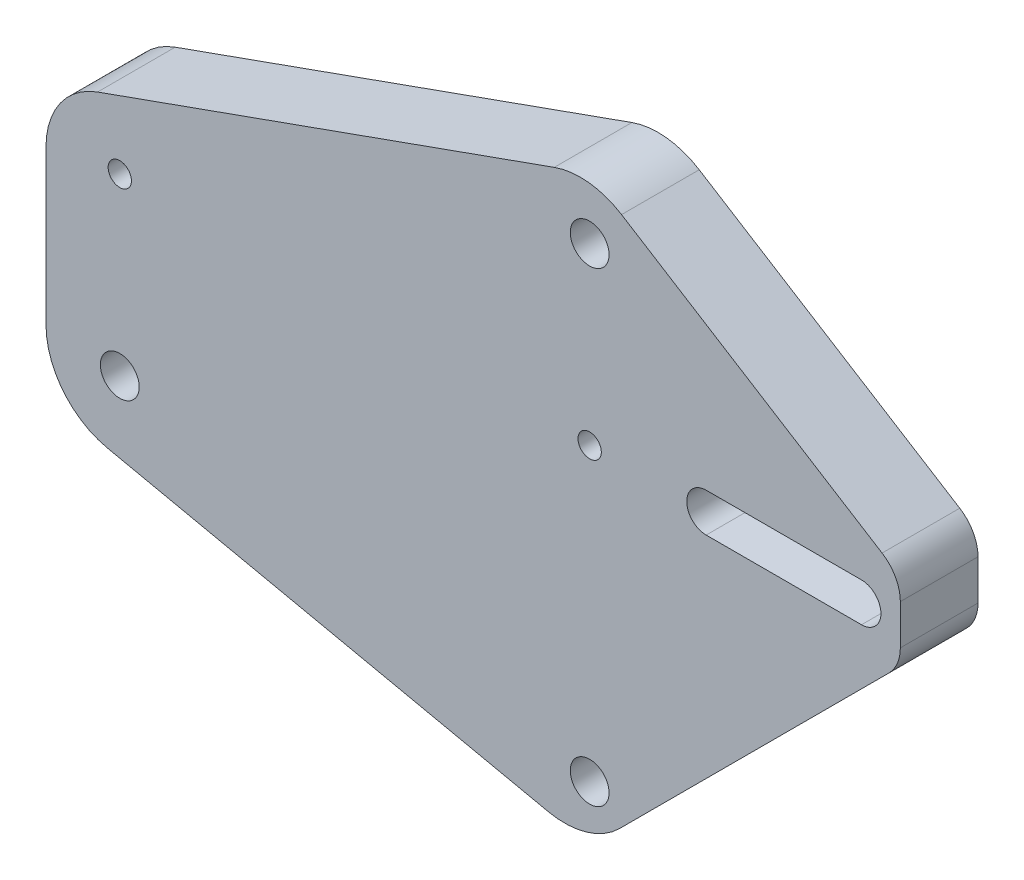
ISO-10303-21;
HEADER;
FILE_DESCRIPTION(('STEP AP214'),'2;1');
FILE_NAME('part.step','',(''),(''),'','','');
FILE_SCHEMA(('AUTOMOTIVE_DESIGN { 1 0 10303 214 1 1 1 1 }'));
ENDSEC;
DATA;
#1=APPLICATION_CONTEXT('core data for automotive mechanical design processes');
#2=APPLICATION_PROTOCOL_DEFINITION('international standard','automotive_design',2000,#1);
#3=PRODUCT_CONTEXT('',#1,'mechanical');
#4=PRODUCT('Part','Part','',(#3));
#5=PRODUCT_RELATED_PRODUCT_CATEGORY('part','',(#4));
#6=PRODUCT_DEFINITION_FORMATION('','',#4);
#7=PRODUCT_DEFINITION_CONTEXT('part definition',#1,'design');
#8=PRODUCT_DEFINITION('design','',#6,#7);
#9=PRODUCT_DEFINITION_SHAPE('','',#8);
#10=(LENGTH_UNIT() NAMED_UNIT(*) SI_UNIT(.MILLI.,.METRE.));
#11=(NAMED_UNIT(*) PLANE_ANGLE_UNIT() SI_UNIT($,.RADIAN.));
#12=(NAMED_UNIT(*) SI_UNIT($,.STERADIAN.) SOLID_ANGLE_UNIT());
#13=UNCERTAINTY_MEASURE_WITH_UNIT(LENGTH_MEASURE(1.E-05),#10,'distance_accuracy_value','');
#14=(GEOMETRIC_REPRESENTATION_CONTEXT(3) GLOBAL_UNCERTAINTY_ASSIGNED_CONTEXT((#13)) GLOBAL_UNIT_ASSIGNED_CONTEXT((#10,
#11,#12)) REPRESENTATION_CONTEXT('',''));
#15=CARTESIAN_POINT('',(0.,0.,0.));
#16=DIRECTION('',(0.,0.,1.));
#17=DIRECTION('',(1.,0.,0.));
#18=AXIS2_PLACEMENT_3D('',#15,#16,#17);
#19=CARTESIAN_POINT('',(-41.1951987154768,23.9545227821022,10.));
#20=DIRECTION('',(0.,0.,1.));
#21=DIRECTION('',(1.,0.,0.));
#22=AXIS2_PLACEMENT_3D('',#19,#20,#21);
#23=PLANE('',#22);
#24=CARTESIAN_POINT('',(-100.5,-17.850085197835,10.));
#25=DIRECTION('',(0.,0.,1.));
#26=DIRECTION('',(1.,0.,0.));
#27=AXIS2_PLACEMENT_3D('',#24,#25,#26);
#28=CIRCLE('',#27,2.5);
#29=CARTESIAN_POINT('',(-98.,-17.850085197835,10.));
#30=VERTEX_POINT('',#29);
#31=EDGE_CURVE('E601',#30,#30,#28,.T.);
#32=ORIENTED_EDGE('',*,*,#31,.F.);
#33=EDGE_LOOP('',(#32));
#34=FACE_BOUND('',#33,.T.);
#35=CARTESIAN_POINT('',(-40.,27.149914802165,10.));
#36=DIRECTION('',(0.,0.,1.));
#37=DIRECTION('',(1.,0.,0.));
#38=AXIS2_PLACEMENT_3D('',#35,#36,#37);
#39=CIRCLE('',#38,2.5);
#40=CARTESIAN_POINT('',(-37.5,27.149914802165,10.));
#41=VERTEX_POINT('',#40);
#42=EDGE_CURVE('E188',#41,#41,#39,.T.);
#43=ORIENTED_EDGE('',*,*,#42,.F.);
#44=EDGE_LOOP('',(#43));
#45=FACE_BOUND('',#44,.T.);
#46=CARTESIAN_POINT('',(-41.1951987154768,23.9545227821022,10.));
#47=DIRECTION('',(0.,0.,1.));
#48=DIRECTION('',(1.,0.,0.));
#49=AXIS2_PLACEMENT_3D('',#46,#47,#48);
#50=CIRCLE('',#49,10.);
#51=CARTESIAN_POINT('',(-35.895209315445,32.4345058221531,10.));
#52=VERTEX_POINT('',#51);
#53=CARTESIAN_POINT('',(-44.5585626854584,33.3719418980506,10.));
#54=VERTEX_POINT('',#53);
#55=EDGE_CURVE('E212',#52,#54,#50,.T.);
#56=ORIENTED_EDGE('',*,*,#55,.T.);
#57=DIRECTION('',(-0.941741911594837,-0.336336396998156,0.));
#58=VECTOR('',#57,1.);
#59=CARTESIAN_POINT('',(-44.5585626854584,33.3719418980506,10.));
#60=LINE('',#59,#58);
#61=CARTESIAN_POINT('',(-103.363363969982,12.370227153578,10.));
#62=VERTEX_POINT('',#61);
#63=EDGE_CURVE('E216',#54,#62,#60,.T.);
#64=ORIENTED_EDGE('',*,*,#63,.T.);
#65=CARTESIAN_POINT('',(-100.,2.95280803762964,10.));
#66=DIRECTION('',(0.,0.,1.));
#67=DIRECTION('',(1.,0.,0.));
#68=AXIS2_PLACEMENT_3D('',#65,#66,#67);
#69=CIRCLE('',#68,9.99999999999998);
#70=CARTESIAN_POINT('',(-110.,2.95280803762964,10.));
#71=VERTEX_POINT('',#70);
#72=EDGE_CURVE('E220',#62,#71,#69,.T.);
#73=ORIENTED_EDGE('',*,*,#72,.T.);
#74=DIRECTION('',(0.,-1.,0.));
#75=VECTOR('',#74,1.);
#76=CARTESIAN_POINT('',(-110.,2.95280803762964,10.));
#77=LINE('',#76,#75);
#78=CARTESIAN_POINT('',(-110.,-16.9158420976597,10.));
#79=VERTEX_POINT('',#78);
#80=EDGE_CURVE('E223',#71,#79,#77,.T.);
#81=ORIENTED_EDGE('',*,*,#80,.T.);
#82=CARTESIAN_POINT('',(-100.,-16.9158420976597,10.));
#83=DIRECTION('',(0.,0.,1.));
#84=DIRECTION('',(1.,0.,0.));
#85=AXIS2_PLACEMENT_3D('',#82,#83,#84);
#86=CIRCLE('',#85,10.);
#87=CARTESIAN_POINT('',(-102.095290887309,-26.6938662384338,10.));
#88=VERTEX_POINT('',#87);
#89=EDGE_CURVE('E226',#79,#88,#86,.T.);
#90=ORIENTED_EDGE('',*,*,#89,.T.);
#91=DIRECTION('',(0.97780241407741,-0.209529088730873,0.));
#92=VECTOR('',#91,1.);
#93=CARTESIAN_POINT('',(-102.095290887309,-26.6938662384338,10.));
#94=LINE('',#93,#92);
#95=CARTESIAN_POINT('',(-45.3195078343364,-38.8601054640708,10.));
#96=VERTEX_POINT('',#95);
#97=EDGE_CURVE('E229',#88,#96,#94,.T.);
#98=ORIENTED_EDGE('',*,*,#97,.T.);
#99=CARTESIAN_POINT('',(-43.2242169470276,-29.0820813232967,10.));
#100=DIRECTION('',(0.,0.,1.));
#101=DIRECTION('',(1.,0.,0.));
#102=AXIS2_PLACEMENT_3D('',#99,#100,#101);
#103=CIRCLE('',#102,10.);
#104=CARTESIAN_POINT('',(-36.1531491351622,-36.1531491351622,10.));
#105=VERTEX_POINT('',#104);
#106=EDGE_CURVE('E232',#96,#105,#103,.T.);
#107=ORIENTED_EDGE('',*,*,#106,.T.);
#108=DIRECTION('',(0.707106781186547,0.707106781186548,0.));
#109=VECTOR('',#108,1.);
#110=CARTESIAN_POINT('',(-36.1531491351622,-36.1531491351622,10.));
#111=LINE('',#110,#109);
#112=CARTESIAN_POINT('',(-1.46446609406726,-1.46446609406727,10.));
#113=VERTEX_POINT('',#112);
#114=EDGE_CURVE('E235',#105,#113,#111,.T.);
#115=ORIENTED_EDGE('',*,*,#114,.T.);
#116=CARTESIAN_POINT('',(-5.,2.07106781186547,10.));
#117=DIRECTION('',(0.,0.,1.));
#118=DIRECTION('',(-1.,0.,0.));
#119=AXIS2_PLACEMENT_3D('',#116,#117,#118);
#120=CIRCLE('',#119,5.);
#121=CARTESIAN_POINT('',(0.,2.07106781186547,10.));
#122=VERTEX_POINT('',#121);
#123=EDGE_CURVE('E238',#113,#122,#120,.T.);
#124=ORIENTED_EDGE('',*,*,#123,.T.);
#125=DIRECTION('',(0.,1.,0.));
#126=VECTOR('',#125,1.);
#127=CARTESIAN_POINT('',(0.,7.22876179246463,10.));
#128=LINE('',#127,#126);
#129=CARTESIAN_POINT('',(0.,7.22876179246463,10.));
#130=VERTEX_POINT('',#129);
#131=EDGE_CURVE('E241',#122,#130,#128,.T.);
#132=ORIENTED_EDGE('',*,*,#131,.T.);
#133=CARTESIAN_POINT('',(-5.,7.22876179246463,10.));
#134=DIRECTION('',(0.,0.,1.));
#135=DIRECTION('',(-1.,0.,0.));
#136=AXIS2_PLACEMENT_3D('',#133,#134,#135);
#137=CIRCLE('',#136,5.);
#138=CARTESIAN_POINT('',(-2.3500052999841,11.4687533124901,10.));
#139=VERTEX_POINT('',#138);
#140=EDGE_CURVE('E244',#130,#139,#137,.T.);
#141=ORIENTED_EDGE('',*,*,#140,.T.);
#142=DIRECTION('',(-0.847998304005088,0.52999894000318,0.));
#143=VECTOR('',#142,1.);
#144=CARTESIAN_POINT('',(-35.895209315445,32.4345058221531,10.));
#145=LINE('',#144,#143);
#146=EDGE_CURVE('E247',#139,#52,#145,.T.);
#147=ORIENTED_EDGE('',*,*,#146,.T.);
#148=EDGE_LOOP('',(#56,#64,#73,#81,#90,#98,#107,#115,#124,#132,#141,#147));
#149=FACE_BOUND('',#148,.T.);
#150=CARTESIAN_POINT('',(-40.,4.64991480216505,10.));
#151=DIRECTION('',(0.,0.,1.));
#152=DIRECTION('',(1.,0.,0.));
#153=AXIS2_PLACEMENT_3D('',#150,#151,#152);
#154=CIRCLE('',#153,1.5);
#155=CARTESIAN_POINT('',(-38.5,4.64991480216505,10.));
#156=VERTEX_POINT('',#155);
#157=EDGE_CURVE('E204',#156,#156,#154,.T.);
#158=ORIENTED_EDGE('',*,*,#157,.F.);
#159=EDGE_LOOP('',(#158));
#160=FACE_BOUND('',#159,.T.);
#161=DIRECTION('',(1.,0.,0.));
#162=VECTOR('',#161,1.);
#163=CARTESIAN_POINT('',(-25.,2.14991480216505,10.));
#164=LINE('',#163,#162);
#165=CARTESIAN_POINT('',(-25.,2.14991480216505,10.));
#166=VERTEX_POINT('',#165);
#167=CARTESIAN_POINT('',(-5.,2.14991480216504,10.));
#168=VERTEX_POINT('',#167);
#169=EDGE_CURVE('E162',#166,#168,#164,.T.);
#170=ORIENTED_EDGE('',*,*,#169,.F.);
#171=CARTESIAN_POINT('',(-25.,4.64991480216505,10.));
#172=DIRECTION('',(0.,0.,1.));
#173=DIRECTION('',(1.,0.,0.));
#174=AXIS2_PLACEMENT_3D('',#171,#172,#173);
#175=CIRCLE('',#174,2.5);
#176=CARTESIAN_POINT('',(-25.,7.14991480216505,10.));
#177=VERTEX_POINT('',#176);
#178=EDGE_CURVE('E153',#177,#166,#175,.T.);
#179=ORIENTED_EDGE('',*,*,#178,.F.);
#180=DIRECTION('',(-1.,0.,0.));
#181=VECTOR('',#180,1.);
#182=CARTESIAN_POINT('',(-25.,7.14991480216505,10.));
#183=LINE('',#182,#181);
#184=CARTESIAN_POINT('',(-5.,7.14991480216505,10.));
#185=VERTEX_POINT('',#184);
#186=EDGE_CURVE('E180',#185,#177,#183,.T.);
#187=ORIENTED_EDGE('',*,*,#186,.F.);
#188=CARTESIAN_POINT('',(-5.,4.64991480216505,10.));
#189=DIRECTION('',(0.,0.,1.));
#190=DIRECTION('',(1.,0.,0.));
#191=AXIS2_PLACEMENT_3D('',#188,#189,#190);
#192=CIRCLE('',#191,2.5);
#193=EDGE_CURVE('E176',#168,#185,#192,.T.);
#194=ORIENTED_EDGE('',*,*,#193,.F.);
#195=EDGE_LOOP('',(#170,#179,#187,#194));
#196=FACE_BOUND('',#195,.T.);
#197=CARTESIAN_POINT('',(-100.5,4.64991480216505,10.));
#198=DIRECTION('',(0.,0.,1.));
#199=DIRECTION('',(1.,0.,0.));
#200=AXIS2_PLACEMENT_3D('',#197,#198,#199);
#201=CIRCLE('',#200,1.5);
#202=CARTESIAN_POINT('',(-99.,4.64991480216505,10.));
#203=VERTEX_POINT('',#202);
#204=EDGE_CURVE('E609',#203,#203,#201,.T.);
#205=ORIENTED_EDGE('',*,*,#204,.F.);
#206=EDGE_LOOP('',(#205));
#207=FACE_BOUND('',#206,.T.);
#208=CARTESIAN_POINT('',(-40.,-32.850085197835,10.));
#209=DIRECTION('',(0.,0.,1.));
#210=DIRECTION('',(1.,0.,0.));
#211=AXIS2_PLACEMENT_3D('',#208,#209,#210);
#212=CIRCLE('',#211,2.5);
#213=CARTESIAN_POINT('',(-37.5,-32.850085197835,10.));
#214=VERTEX_POINT('',#213);
#215=EDGE_CURVE('E590',#214,#214,#212,.T.);
#216=ORIENTED_EDGE('',*,*,#215,.F.);
#217=EDGE_LOOP('',(#216));
#218=FACE_BOUND('',#217,.T.);
#219=ADVANCED_FACE('F39',(#34,#45,#149,#160,#196,#207,#218),#23,.T.);
#220=CARTESIAN_POINT('',(-41.1951987154768,23.9545227821022,0.));
#221=DIRECTION('',(0.,0.,1.));
#222=DIRECTION('',(1.,0.,0.));
#223=AXIS2_PLACEMENT_3D('',#220,#221,#222);
#224=PLANE('',#223);
#225=CARTESIAN_POINT('',(-40.,4.64991480216505,0.));
#226=DIRECTION('',(0.,0.,1.));
#227=DIRECTION('',(1.,0.,0.));
#228=AXIS2_PLACEMENT_3D('',#225,#226,#227);
#229=CIRCLE('',#228,1.5);
#230=CARTESIAN_POINT('',(-38.5,4.64991480216505,0.));
#231=VERTEX_POINT('',#230);
#232=EDGE_CURVE('E171',#231,#231,#229,.T.);
#233=ORIENTED_EDGE('',*,*,#232,.T.);
#234=EDGE_LOOP('',(#233));
#235=FACE_BOUND('',#234,.T.);
#236=CARTESIAN_POINT('',(-41.1951987154768,23.9545227821022,0.));
#237=DIRECTION('',(0.,0.,1.));
#238=DIRECTION('',(1.,0.,0.));
#239=AXIS2_PLACEMENT_3D('',#236,#237,#238);
#240=CIRCLE('',#239,10.);
#241=CARTESIAN_POINT('',(-35.895209315445,32.4345058221531,0.));
#242=VERTEX_POINT('',#241);
#243=CARTESIAN_POINT('',(-44.5585626854584,33.3719418980506,0.));
#244=VERTEX_POINT('',#243);
#245=EDGE_CURVE('E208',#242,#244,#240,.T.);
#246=ORIENTED_EDGE('',*,*,#245,.F.);
#247=DIRECTION('',(-0.847998304005088,0.52999894000318,0.));
#248=VECTOR('',#247,1.);
#249=CARTESIAN_POINT('',(-35.895209315445,32.4345058221531,0.));
#250=LINE('',#249,#248);
#251=CARTESIAN_POINT('',(-2.3500052999841,11.4687533124901,0.));
#252=VERTEX_POINT('',#251);
#253=EDGE_CURVE('E217',#252,#242,#250,.T.);
#254=ORIENTED_EDGE('',*,*,#253,.F.);
#255=CARTESIAN_POINT('',(-5.,7.22876179246463,0.));
#256=DIRECTION('',(0.,0.,1.));
#257=DIRECTION('',(-1.,0.,0.));
#258=AXIS2_PLACEMENT_3D('',#255,#256,#257);
#259=CIRCLE('',#258,5.);
#260=CARTESIAN_POINT('',(0.,7.22876179246463,0.));
#261=VERTEX_POINT('',#260);
#262=EDGE_CURVE('E281',#261,#252,#259,.T.);
#263=ORIENTED_EDGE('',*,*,#262,.F.);
#264=DIRECTION('',(0.,1.,0.));
#265=VECTOR('',#264,1.);
#266=CARTESIAN_POINT('',(0.,7.22876179246463,0.));
#267=LINE('',#266,#265);
#268=CARTESIAN_POINT('',(0.,2.07106781186547,0.));
#269=VERTEX_POINT('',#268);
#270=EDGE_CURVE('E278',#269,#261,#267,.T.);
#271=ORIENTED_EDGE('',*,*,#270,.F.);
#272=CARTESIAN_POINT('',(-5.,2.07106781186547,0.));
#273=DIRECTION('',(0.,0.,1.));
#274=DIRECTION('',(-1.,0.,0.));
#275=AXIS2_PLACEMENT_3D('',#272,#273,#274);
#276=CIRCLE('',#275,5.);
#277=CARTESIAN_POINT('',(-1.46446609406726,-1.46446609406727,0.));
#278=VERTEX_POINT('',#277);
#279=EDGE_CURVE('E275',#278,#269,#276,.T.);
#280=ORIENTED_EDGE('',*,*,#279,.F.);
#281=DIRECTION('',(0.707106781186547,0.707106781186548,0.));
#282=VECTOR('',#281,1.);
#283=CARTESIAN_POINT('',(-36.1531491351622,-36.1531491351622,0.));
#284=LINE('',#283,#282);
#285=CARTESIAN_POINT('',(-36.1531491351622,-36.1531491351622,0.));
#286=VERTEX_POINT('',#285);
#287=EDGE_CURVE('E272',#286,#278,#284,.T.);
#288=ORIENTED_EDGE('',*,*,#287,.F.);
#289=CARTESIAN_POINT('',(-43.2242169470276,-29.0820813232967,0.));
#290=DIRECTION('',(0.,0.,1.));
#291=DIRECTION('',(1.,0.,0.));
#292=AXIS2_PLACEMENT_3D('',#289,#290,#291);
#293=CIRCLE('',#292,10.);
#294=CARTESIAN_POINT('',(-45.3195078343364,-38.8601054640708,0.));
#295=VERTEX_POINT('',#294);
#296=EDGE_CURVE('E269',#295,#286,#293,.T.);
#297=ORIENTED_EDGE('',*,*,#296,.F.);
#298=DIRECTION('',(0.97780241407741,-0.209529088730873,0.));
#299=VECTOR('',#298,1.);
#300=CARTESIAN_POINT('',(-102.095290887309,-26.6938662384338,0.));
#301=LINE('',#300,#299);
#302=CARTESIAN_POINT('',(-102.095290887309,-26.6938662384338,0.));
#303=VERTEX_POINT('',#302);
#304=EDGE_CURVE('E266',#303,#295,#301,.T.);
#305=ORIENTED_EDGE('',*,*,#304,.F.);
#306=CARTESIAN_POINT('',(-100.,-16.9158420976597,0.));
#307=DIRECTION('',(0.,0.,1.));
#308=DIRECTION('',(1.,0.,0.));
#309=AXIS2_PLACEMENT_3D('',#306,#307,#308);
#310=CIRCLE('',#309,10.);
#311=CARTESIAN_POINT('',(-110.,-16.9158420976597,0.));
#312=VERTEX_POINT('',#311);
#313=EDGE_CURVE('E263',#312,#303,#310,.T.);
#314=ORIENTED_EDGE('',*,*,#313,.F.);
#315=DIRECTION('',(0.,-1.,0.));
#316=VECTOR('',#315,1.);
#317=CARTESIAN_POINT('',(-110.,2.95280803762964,0.));
#318=LINE('',#317,#316);
#319=CARTESIAN_POINT('',(-110.,2.95280803762964,0.));
#320=VERTEX_POINT('',#319);
#321=EDGE_CURVE('E260',#320,#312,#318,.T.);
#322=ORIENTED_EDGE('',*,*,#321,.F.);
#323=CARTESIAN_POINT('',(-100.,2.95280803762964,0.));
#324=DIRECTION('',(0.,0.,1.));
#325=DIRECTION('',(1.,0.,0.));
#326=AXIS2_PLACEMENT_3D('',#323,#324,#325);
#327=CIRCLE('',#326,9.99999999999998);
#328=CARTESIAN_POINT('',(-103.363363969982,12.370227153578,0.));
#329=VERTEX_POINT('',#328);
#330=EDGE_CURVE('E257',#329,#320,#327,.T.);
#331=ORIENTED_EDGE('',*,*,#330,.F.);
#332=DIRECTION('',(-0.941741911594837,-0.336336396998156,0.));
#333=VECTOR('',#332,1.);
#334=CARTESIAN_POINT('',(-44.5585626854584,33.3719418980506,0.));
#335=LINE('',#334,#333);
#336=EDGE_CURVE('E254',#244,#329,#335,.T.);
#337=ORIENTED_EDGE('',*,*,#336,.F.);
#338=EDGE_LOOP('',(#246,#254,#263,#271,#280,#288,#297,#305,#314,#322,#331,#337));
#339=FACE_BOUND('',#338,.T.);
#340=CARTESIAN_POINT('',(-25.,4.64991480216505,0.));
#341=DIRECTION('',(0.,0.,1.));
#342=DIRECTION('',(1.,0.,0.));
#343=AXIS2_PLACEMENT_3D('',#340,#341,#342);
#344=CIRCLE('',#343,2.5);
#345=CARTESIAN_POINT('',(-25.,7.14991480216505,0.));
#346=VERTEX_POINT('',#345);
#347=CARTESIAN_POINT('',(-25.,2.14991480216505,0.));
#348=VERTEX_POINT('',#347);
#349=EDGE_CURVE('E63',#346,#348,#344,.T.);
#350=ORIENTED_EDGE('',*,*,#349,.T.);
#351=DIRECTION('',(1.,0.,0.));
#352=VECTOR('',#351,1.);
#353=CARTESIAN_POINT('',(-25.,2.14991480216505,0.));
#354=LINE('',#353,#352);
#355=CARTESIAN_POINT('',(-5.,2.14991480216504,0.));
#356=VERTEX_POINT('',#355);
#357=EDGE_CURVE('E169',#348,#356,#354,.T.);
#358=ORIENTED_EDGE('',*,*,#357,.T.);
#359=CARTESIAN_POINT('',(-5.,4.64991480216505,0.));
#360=DIRECTION('',(0.,0.,1.));
#361=DIRECTION('',(1.,0.,0.));
#362=AXIS2_PLACEMENT_3D('',#359,#360,#361);
#363=CIRCLE('',#362,2.5);
#364=CARTESIAN_POINT('',(-5.,7.14991480216505,0.));
#365=VERTEX_POINT('',#364);
#366=EDGE_CURVE('E191',#356,#365,#363,.T.);
#367=ORIENTED_EDGE('',*,*,#366,.T.);
#368=DIRECTION('',(-1.,0.,0.));
#369=VECTOR('',#368,1.);
#370=CARTESIAN_POINT('',(-25.,7.14991480216505,0.));
#371=LINE('',#370,#369);
#372=EDGE_CURVE('E163',#365,#346,#371,.T.);
#373=ORIENTED_EDGE('',*,*,#372,.T.);
#374=EDGE_LOOP('',(#350,#358,#367,#373));
#375=FACE_BOUND('',#374,.T.);
#376=CARTESIAN_POINT('',(-40.,27.149914802165,0.));
#377=DIRECTION('',(0.,0.,1.));
#378=DIRECTION('',(1.,0.,0.));
#379=AXIS2_PLACEMENT_3D('',#376,#377,#378);
#380=CIRCLE('',#379,2.5);
#381=CARTESIAN_POINT('',(-37.5,27.149914802165,0.));
#382=VERTEX_POINT('',#381);
#383=EDGE_CURVE('E613',#382,#382,#380,.T.);
#384=ORIENTED_EDGE('',*,*,#383,.T.);
#385=EDGE_LOOP('',(#384));
#386=FACE_BOUND('',#385,.T.);
#387=CARTESIAN_POINT('',(-100.5,4.64991480216505,0.));
#388=DIRECTION('',(0.,0.,1.));
#389=DIRECTION('',(1.,0.,0.));
#390=AXIS2_PLACEMENT_3D('',#387,#388,#389);
#391=CIRCLE('',#390,1.5);
#392=CARTESIAN_POINT('',(-99.,4.64991480216505,0.));
#393=VERTEX_POINT('',#392);
#394=EDGE_CURVE('E605',#393,#393,#391,.T.);
#395=ORIENTED_EDGE('',*,*,#394,.T.);
#396=EDGE_LOOP('',(#395));
#397=FACE_BOUND('',#396,.T.);
#398=CARTESIAN_POINT('',(-100.5,-17.850085197835,0.));
#399=DIRECTION('',(0.,0.,1.));
#400=DIRECTION('',(1.,0.,0.));
#401=AXIS2_PLACEMENT_3D('',#398,#399,#400);
#402=CIRCLE('',#401,2.5);
#403=CARTESIAN_POINT('',(-98.,-17.850085197835,0.));
#404=VERTEX_POINT('',#403);
#405=EDGE_CURVE('E598',#404,#404,#402,.T.);
#406=ORIENTED_EDGE('',*,*,#405,.T.);
#407=EDGE_LOOP('',(#406));
#408=FACE_BOUND('',#407,.T.);
#409=CARTESIAN_POINT('',(-40.,-32.850085197835,0.));
#410=DIRECTION('',(0.,0.,1.));
#411=DIRECTION('',(1.,0.,0.));
#412=AXIS2_PLACEMENT_3D('',#409,#410,#411);
#413=CIRCLE('',#412,2.5);
#414=CARTESIAN_POINT('',(-37.5,-32.850085197835,0.));
#415=VERTEX_POINT('',#414);
#416=EDGE_CURVE('E593',#415,#415,#413,.T.);
#417=ORIENTED_EDGE('',*,*,#416,.T.);
#418=EDGE_LOOP('',(#417));
#419=FACE_BOUND('',#418,.T.);
#420=ADVANCED_FACE('F336',(#235,#339,#375,#386,#397,#408,#419),#224,.F.);
#421=CARTESIAN_POINT('',(-41.1951987154768,23.9545227821022,10.));
#422=DIRECTION('',(0.,0.,-1.));
#423=DIRECTION('',(-1.,0.,0.));
#424=AXIS2_PLACEMENT_3D('',#421,#422,#423);
#425=CYLINDRICAL_SURFACE('',#424,10.);
#426=ORIENTED_EDGE('',*,*,#245,.T.);
#427=DIRECTION('',(0.,0.,-1.));
#428=VECTOR('',#427,1.);
#429=CARTESIAN_POINT('',(-44.5585626854584,33.3719418980506,10.));
#430=LINE('',#429,#428);
#431=EDGE_CURVE('E11',#54,#244,#430,.T.);
#432=ORIENTED_EDGE('',*,*,#431,.F.);
#433=ORIENTED_EDGE('',*,*,#55,.F.);
#434=DIRECTION('',(0.,0.,-1.));
#435=VECTOR('',#434,1.);
#436=CARTESIAN_POINT('',(-35.895209315445,32.4345058221531,10.));
#437=LINE('',#436,#435);
#438=EDGE_CURVE('E250',#52,#242,#437,.T.);
#439=ORIENTED_EDGE('',*,*,#438,.T.);
#440=EDGE_LOOP('',(#426,#432,#433,#439));
#441=FACE_BOUND('',#440,.T.);
#442=ADVANCED_FACE('F41',(#441),#425,.T.);
#443=CARTESIAN_POINT('',(-44.5585626854584,33.3719418980506,10.));
#444=DIRECTION('',(0.336336396998156,-0.941741911594837,0.));
#445=DIRECTION('',(0.941741911594837,0.336336396998156,0.));
#446=AXIS2_PLACEMENT_3D('',#443,#444,#445);
#447=PLANE('',#446);
#448=ORIENTED_EDGE('',*,*,#336,.T.);
#449=DIRECTION('',(0.,0.,-1.));
#450=VECTOR('',#449,1.);
#451=CARTESIAN_POINT('',(-103.363363969982,12.370227153578,10.));
#452=LINE('',#451,#450);
#453=EDGE_CURVE('E48',#62,#329,#452,.T.);
#454=ORIENTED_EDGE('',*,*,#453,.F.);
#455=ORIENTED_EDGE('',*,*,#63,.F.);
#456=ORIENTED_EDGE('',*,*,#431,.T.);
#457=EDGE_LOOP('',(#448,#454,#455,#456));
#458=FACE_BOUND('',#457,.T.);
#459=ADVANCED_FACE('F354',(#458),#447,.F.);
#460=CARTESIAN_POINT('',(-100.,2.95280803762964,10.));
#461=DIRECTION('',(0.,0.,-1.));
#462=DIRECTION('',(-1.,0.,0.));
#463=AXIS2_PLACEMENT_3D('',#460,#461,#462);
#464=CYLINDRICAL_SURFACE('',#463,9.99999999999998);
#465=ORIENTED_EDGE('',*,*,#330,.T.);
#466=DIRECTION('',(0.,0.,-1.));
#467=VECTOR('',#466,1.);
#468=CARTESIAN_POINT('',(-110.,2.95280803762964,10.));
#469=LINE('',#468,#467);
#470=EDGE_CURVE('E321',#71,#320,#469,.T.);
#471=ORIENTED_EDGE('',*,*,#470,.F.);
#472=ORIENTED_EDGE('',*,*,#72,.F.);
#473=ORIENTED_EDGE('',*,*,#453,.T.);
#474=EDGE_LOOP('',(#465,#471,#472,#473));
#475=FACE_BOUND('',#474,.T.);
#476=ADVANCED_FACE('F330',(#475),#464,.T.);
#477=CARTESIAN_POINT('',(-110.,2.95280803762964,10.));
#478=DIRECTION('',(1.,0.,0.));
#479=DIRECTION('',(0.,1.,0.));
#480=AXIS2_PLACEMENT_3D('',#477,#478,#479);
#481=PLANE('',#480);
#482=ORIENTED_EDGE('',*,*,#321,.T.);
#483=DIRECTION('',(0.,0.,-1.));
#484=VECTOR('',#483,1.);
#485=CARTESIAN_POINT('',(-110.,-16.9158420976597,10.));
#486=LINE('',#485,#484);
#487=EDGE_CURVE('E317',#79,#312,#486,.T.);
#488=ORIENTED_EDGE('',*,*,#487,.F.);
#489=ORIENTED_EDGE('',*,*,#80,.F.);
#490=ORIENTED_EDGE('',*,*,#470,.T.);
#491=EDGE_LOOP('',(#482,#488,#489,#490));
#492=FACE_BOUND('',#491,.T.);
#493=ADVANCED_FACE('F342',(#492),#481,.F.);
#494=CARTESIAN_POINT('',(-100.,-16.9158420976597,10.));
#495=DIRECTION('',(0.,0.,-1.));
#496=DIRECTION('',(-1.,0.,0.));
#497=AXIS2_PLACEMENT_3D('',#494,#495,#496);
#498=CYLINDRICAL_SURFACE('',#497,10.);
#499=ORIENTED_EDGE('',*,*,#313,.T.);
#500=DIRECTION('',(0.,0.,-1.));
#501=VECTOR('',#500,1.);
#502=CARTESIAN_POINT('',(-102.095290887309,-26.6938662384338,10.));
#503=LINE('',#502,#501);
#504=EDGE_CURVE('E313',#88,#303,#503,.T.);
#505=ORIENTED_EDGE('',*,*,#504,.F.);
#506=ORIENTED_EDGE('',*,*,#89,.F.);
#507=ORIENTED_EDGE('',*,*,#487,.T.);
#508=EDGE_LOOP('',(#499,#505,#506,#507));
#509=FACE_BOUND('',#508,.T.);
#510=ADVANCED_FACE('F346',(#509),#498,.T.);
#511=CARTESIAN_POINT('',(-102.095290887309,-26.6938662384338,10.));
#512=DIRECTION('',(0.209529088730873,0.97780241407741,0.));
#513=DIRECTION('',(-0.97780241407741,0.209529088730873,0.));
#514=AXIS2_PLACEMENT_3D('',#511,#512,#513);
#515=PLANE('',#514);
#516=ORIENTED_EDGE('',*,*,#304,.T.);
#517=DIRECTION('',(0.,0.,-1.));
#518=VECTOR('',#517,1.);
#519=CARTESIAN_POINT('',(-45.3195078343364,-38.8601054640708,10.));
#520=LINE('',#519,#518);
#521=EDGE_CURVE('E309',#96,#295,#520,.T.);
#522=ORIENTED_EDGE('',*,*,#521,.F.);
#523=ORIENTED_EDGE('',*,*,#97,.F.);
#524=ORIENTED_EDGE('',*,*,#504,.T.);
#525=EDGE_LOOP('',(#516,#522,#523,#524));
#526=FACE_BOUND('',#525,.T.);
#527=ADVANCED_FACE('F387',(#526),#515,.F.);
#528=CARTESIAN_POINT('',(-43.2242169470276,-29.0820813232967,10.));
#529=DIRECTION('',(0.,0.,-1.));
#530=DIRECTION('',(-1.,0.,0.));
#531=AXIS2_PLACEMENT_3D('',#528,#529,#530);
#532=CYLINDRICAL_SURFACE('',#531,10.);
#533=ORIENTED_EDGE('',*,*,#296,.T.);
#534=DIRECTION('',(0.,0.,-1.));
#535=VECTOR('',#534,1.);
#536=CARTESIAN_POINT('',(-36.1531491351622,-36.1531491351622,10.));
#537=LINE('',#536,#535);
#538=EDGE_CURVE('E305',#105,#286,#537,.T.);
#539=ORIENTED_EDGE('',*,*,#538,.F.);
#540=ORIENTED_EDGE('',*,*,#106,.F.);
#541=ORIENTED_EDGE('',*,*,#521,.T.);
#542=EDGE_LOOP('',(#533,#539,#540,#541));
#543=FACE_BOUND('',#542,.T.);
#544=ADVANCED_FACE('F385',(#543),#532,.T.);
#545=CARTESIAN_POINT('',(-36.1531491351622,-36.1531491351622,10.));
#546=DIRECTION('',(-0.707106781186548,0.707106781186547,0.));
#547=DIRECTION('',(-0.707106781186547,-0.707106781186548,0.));
#548=AXIS2_PLACEMENT_3D('',#545,#546,#547);
#549=PLANE('',#548);
#550=ORIENTED_EDGE('',*,*,#287,.T.);
#551=DIRECTION('',(0.,0.,-1.));
#552=VECTOR('',#551,1.);
#553=CARTESIAN_POINT('',(-1.46446609406726,-1.46446609406727,10.));
#554=LINE('',#553,#552);
#555=EDGE_CURVE('E301',#113,#278,#554,.T.);
#556=ORIENTED_EDGE('',*,*,#555,.F.);
#557=ORIENTED_EDGE('',*,*,#114,.F.);
#558=ORIENTED_EDGE('',*,*,#538,.T.);
#559=EDGE_LOOP('',(#550,#556,#557,#558));
#560=FACE_BOUND('',#559,.T.);
#561=ADVANCED_FACE('F381',(#560),#549,.F.);
#562=CARTESIAN_POINT('',(-5.,2.07106781186547,10.));
#563=DIRECTION('',(0.,0.,-1.));
#564=DIRECTION('',(-1.,0.,0.));
#565=AXIS2_PLACEMENT_3D('',#562,#563,#564);
#566=CYLINDRICAL_SURFACE('',#565,5.);
#567=ORIENTED_EDGE('',*,*,#279,.T.);
#568=DIRECTION('',(0.,0.,-1.));
#569=VECTOR('',#568,1.);
#570=CARTESIAN_POINT('',(0.,2.07106781186547,10.));
#571=LINE('',#570,#569);
#572=EDGE_CURVE('E297',#122,#269,#571,.T.);
#573=ORIENTED_EDGE('',*,*,#572,.F.);
#574=ORIENTED_EDGE('',*,*,#123,.F.);
#575=ORIENTED_EDGE('',*,*,#555,.T.);
#576=EDGE_LOOP('',(#567,#573,#574,#575));
#577=FACE_BOUND('',#576,.T.);
#578=ADVANCED_FACE('F376',(#577),#566,.T.);
#579=CARTESIAN_POINT('',(0.,7.22876179246463,10.));
#580=DIRECTION('',(-1.,0.,0.));
#581=DIRECTION('',(0.,0.,1.));
#582=AXIS2_PLACEMENT_3D('',#579,#580,#581);
#583=PLANE('',#582);
#584=ORIENTED_EDGE('',*,*,#270,.T.);
#585=DIRECTION('',(0.,0.,-1.));
#586=VECTOR('',#585,1.);
#587=CARTESIAN_POINT('',(0.,7.22876179246463,10.));
#588=LINE('',#587,#586);
#589=EDGE_CURVE('E293',#130,#261,#588,.T.);
#590=ORIENTED_EDGE('',*,*,#589,.F.);
#591=ORIENTED_EDGE('',*,*,#131,.F.);
#592=ORIENTED_EDGE('',*,*,#572,.T.);
#593=EDGE_LOOP('',(#584,#590,#591,#592));
#594=FACE_BOUND('',#593,.T.);
#595=ADVANCED_FACE('F370',(#594),#583,.F.);
#596=CARTESIAN_POINT('',(-5.,7.22876179246463,10.));
#597=DIRECTION('',(0.,0.,-1.));
#598=DIRECTION('',(-1.,0.,0.));
#599=AXIS2_PLACEMENT_3D('',#596,#597,#598);
#600=CYLINDRICAL_SURFACE('',#599,5.);
#601=ORIENTED_EDGE('',*,*,#262,.T.);
#602=DIRECTION('',(0.,0.,-1.));
#603=VECTOR('',#602,1.);
#604=CARTESIAN_POINT('',(-2.3500052999841,11.4687533124901,10.));
#605=LINE('',#604,#603);
#606=EDGE_CURVE('E289',#139,#252,#605,.T.);
#607=ORIENTED_EDGE('',*,*,#606,.F.);
#608=ORIENTED_EDGE('',*,*,#140,.F.);
#609=ORIENTED_EDGE('',*,*,#589,.T.);
#610=EDGE_LOOP('',(#601,#607,#608,#609));
#611=FACE_BOUND('',#610,.T.);
#612=ADVANCED_FACE('F366',(#611),#600,.T.);
#613=CARTESIAN_POINT('',(-35.895209315445,32.4345058221531,10.));
#614=DIRECTION('',(-0.52999894000318,-0.847998304005088,0.));
#615=DIRECTION('',(0.847998304005088,-0.52999894000318,0.));
#616=AXIS2_PLACEMENT_3D('',#613,#614,#615);
#617=PLANE('',#616);
#618=ORIENTED_EDGE('',*,*,#253,.T.);
#619=ORIENTED_EDGE('',*,*,#438,.F.);
#620=ORIENTED_EDGE('',*,*,#146,.F.);
#621=ORIENTED_EDGE('',*,*,#606,.T.);
#622=EDGE_LOOP('',(#618,#619,#620,#621));
#623=FACE_BOUND('',#622,.T.);
#624=ADVANCED_FACE('F361',(#623),#617,.F.);
#625=CARTESIAN_POINT('',(-40.,4.64991480216505,10.));
#626=DIRECTION('',(0.,0.,-1.));
#627=DIRECTION('',(-1.,0.,0.));
#628=AXIS2_PLACEMENT_3D('',#625,#626,#627);
#629=CYLINDRICAL_SURFACE('',#628,1.5);
#630=ORIENTED_EDGE('',*,*,#157,.T.);
#631=EDGE_LOOP('',(#630));
#632=FACE_BOUND('',#631,.T.);
#633=ORIENTED_EDGE('',*,*,#232,.F.);
#634=EDGE_LOOP('',(#633));
#635=FACE_BOUND('',#634,.T.);
#636=ADVANCED_FACE('F407',(#632,#635),#629,.F.);
#637=CARTESIAN_POINT('',(-25.,4.64991480216505,10.));
#638=DIRECTION('',(0.,0.,-1.));
#639=DIRECTION('',(-1.,0.,0.));
#640=AXIS2_PLACEMENT_3D('',#637,#638,#639);
#641=CYLINDRICAL_SURFACE('',#640,2.5);
#642=ORIENTED_EDGE('',*,*,#349,.F.);
#643=DIRECTION('',(0.,0.,-1.));
#644=VECTOR('',#643,1.);
#645=CARTESIAN_POINT('',(-25.,7.14991480216505,10.));
#646=LINE('',#645,#644);
#647=EDGE_CURVE('E157',#177,#346,#646,.T.);
#648=ORIENTED_EDGE('',*,*,#647,.F.);
#649=ORIENTED_EDGE('',*,*,#178,.T.);
#650=DIRECTION('',(0.,0.,-1.));
#651=VECTOR('',#650,1.);
#652=CARTESIAN_POINT('',(-25.,2.14991480216505,10.));
#653=LINE('',#652,#651);
#654=EDGE_CURVE('E156',#166,#348,#653,.T.);
#655=ORIENTED_EDGE('',*,*,#654,.T.);
#656=EDGE_LOOP('',(#642,#648,#649,#655));
#657=FACE_BOUND('',#656,.T.);
#658=ADVANCED_FACE('F155',(#657),#641,.F.);
#659=CARTESIAN_POINT('',(-25.,2.14991480216505,10.));
#660=DIRECTION('',(0.,1.,0.));
#661=DIRECTION('',(0.,0.,1.));
#662=AXIS2_PLACEMENT_3D('',#659,#660,#661);
#663=PLANE('',#662);
#664=ORIENTED_EDGE('',*,*,#357,.F.);
#665=ORIENTED_EDGE('',*,*,#654,.F.);
#666=ORIENTED_EDGE('',*,*,#169,.T.);
#667=DIRECTION('',(0.,0.,-1.));
#668=VECTOR('',#667,1.);
#669=CARTESIAN_POINT('',(-5.,2.14991480216504,10.));
#670=LINE('',#669,#668);
#671=EDGE_CURVE('E172',#168,#356,#670,.T.);
#672=ORIENTED_EDGE('',*,*,#671,.T.);
#673=EDGE_LOOP('',(#664,#665,#666,#672));
#674=FACE_BOUND('',#673,.T.);
#675=ADVANCED_FACE('F166',(#674),#663,.T.);
#676=CARTESIAN_POINT('',(-5.,4.64991480216505,10.));
#677=DIRECTION('',(0.,0.,-1.));
#678=DIRECTION('',(-1.,0.,0.));
#679=AXIS2_PLACEMENT_3D('',#676,#677,#678);
#680=CYLINDRICAL_SURFACE('',#679,2.5);
#681=ORIENTED_EDGE('',*,*,#366,.F.);
#682=ORIENTED_EDGE('',*,*,#671,.F.);
#683=ORIENTED_EDGE('',*,*,#193,.T.);
#684=DIRECTION('',(0.,0.,-1.));
#685=VECTOR('',#684,1.);
#686=CARTESIAN_POINT('',(-5.,7.14991480216505,10.));
#687=LINE('',#686,#685);
#688=EDGE_CURVE('E55',#185,#365,#687,.T.);
#689=ORIENTED_EDGE('',*,*,#688,.T.);
#690=EDGE_LOOP('',(#681,#682,#683,#689));
#691=FACE_BOUND('',#690,.T.);
#692=ADVANCED_FACE('F456',(#691),#680,.F.);
#693=CARTESIAN_POINT('',(-25.,7.14991480216505,10.));
#694=DIRECTION('',(0.,-1.,0.));
#695=DIRECTION('',(0.,0.,-1.));
#696=AXIS2_PLACEMENT_3D('',#693,#694,#695);
#697=PLANE('',#696);
#698=ORIENTED_EDGE('',*,*,#372,.F.);
#699=ORIENTED_EDGE('',*,*,#688,.F.);
#700=ORIENTED_EDGE('',*,*,#186,.T.);
#701=ORIENTED_EDGE('',*,*,#647,.T.);
#702=EDGE_LOOP('',(#698,#699,#700,#701));
#703=FACE_BOUND('',#702,.T.);
#704=ADVANCED_FACE('F463',(#703),#697,.T.);
#705=CARTESIAN_POINT('',(-40.,27.149914802165,10.));
#706=DIRECTION('',(0.,0.,-1.));
#707=DIRECTION('',(-1.,0.,0.));
#708=AXIS2_PLACEMENT_3D('',#705,#706,#707);
#709=CYLINDRICAL_SURFACE('',#708,2.5);
#710=ORIENTED_EDGE('',*,*,#42,.T.);
#711=EDGE_LOOP('',(#710));
#712=FACE_BOUND('',#711,.T.);
#713=ORIENTED_EDGE('',*,*,#383,.F.);
#714=EDGE_LOOP('',(#713));
#715=FACE_BOUND('',#714,.T.);
#716=ADVANCED_FACE('F471',(#712,#715),#709,.F.);
#717=CARTESIAN_POINT('',(-100.5,4.64991480216505,10.));
#718=DIRECTION('',(0.,0.,-1.));
#719=DIRECTION('',(-1.,0.,0.));
#720=AXIS2_PLACEMENT_3D('',#717,#718,#719);
#721=CYLINDRICAL_SURFACE('',#720,1.5);
#722=ORIENTED_EDGE('',*,*,#204,.T.);
#723=EDGE_LOOP('',(#722));
#724=FACE_BOUND('',#723,.T.);
#725=ORIENTED_EDGE('',*,*,#394,.F.);
#726=EDGE_LOOP('',(#725));
#727=FACE_BOUND('',#726,.T.);
#728=ADVANCED_FACE('F478',(#724,#727),#721,.F.);
#729=CARTESIAN_POINT('',(-100.5,-17.850085197835,10.));
#730=DIRECTION('',(0.,0.,-1.));
#731=DIRECTION('',(-1.,0.,0.));
#732=AXIS2_PLACEMENT_3D('',#729,#730,#731);
#733=CYLINDRICAL_SURFACE('',#732,2.5);
#734=ORIENTED_EDGE('',*,*,#31,.T.);
#735=EDGE_LOOP('',(#734));
#736=FACE_BOUND('',#735,.T.);
#737=ORIENTED_EDGE('',*,*,#405,.F.);
#738=EDGE_LOOP('',(#737));
#739=FACE_BOUND('',#738,.T.);
#740=ADVANCED_FACE('F486',(#736,#739),#733,.F.);
#741=CARTESIAN_POINT('',(-40.,-32.850085197835,10.));
#742=DIRECTION('',(0.,0.,-1.));
#743=DIRECTION('',(-1.,0.,0.));
#744=AXIS2_PLACEMENT_3D('',#741,#742,#743);
#745=CYLINDRICAL_SURFACE('',#744,2.5);
#746=ORIENTED_EDGE('',*,*,#215,.T.);
#747=EDGE_LOOP('',(#746));
#748=FACE_BOUND('',#747,.T.);
#749=ORIENTED_EDGE('',*,*,#416,.F.);
#750=EDGE_LOOP('',(#749));
#751=FACE_BOUND('',#750,.T.);
#752=ADVANCED_FACE('F494',(#748,#751),#745,.F.);
#753=CLOSED_SHELL('',(#219,#420,#442,#459,#476,#493,#510,#527,#544,#561,#578,#595,#612,#624,
#636,#658,#675,#692,#704,#716,#728,#740,#752));
#754=MANIFOLD_SOLID_BREP('B2',#753);
#755=ADVANCED_BREP_SHAPE_REPRESENTATION('',(#18,#754),#14);
#756=SHAPE_DEFINITION_REPRESENTATION(#9,#755);
ENDSEC;
END-ISO-10303-21;
